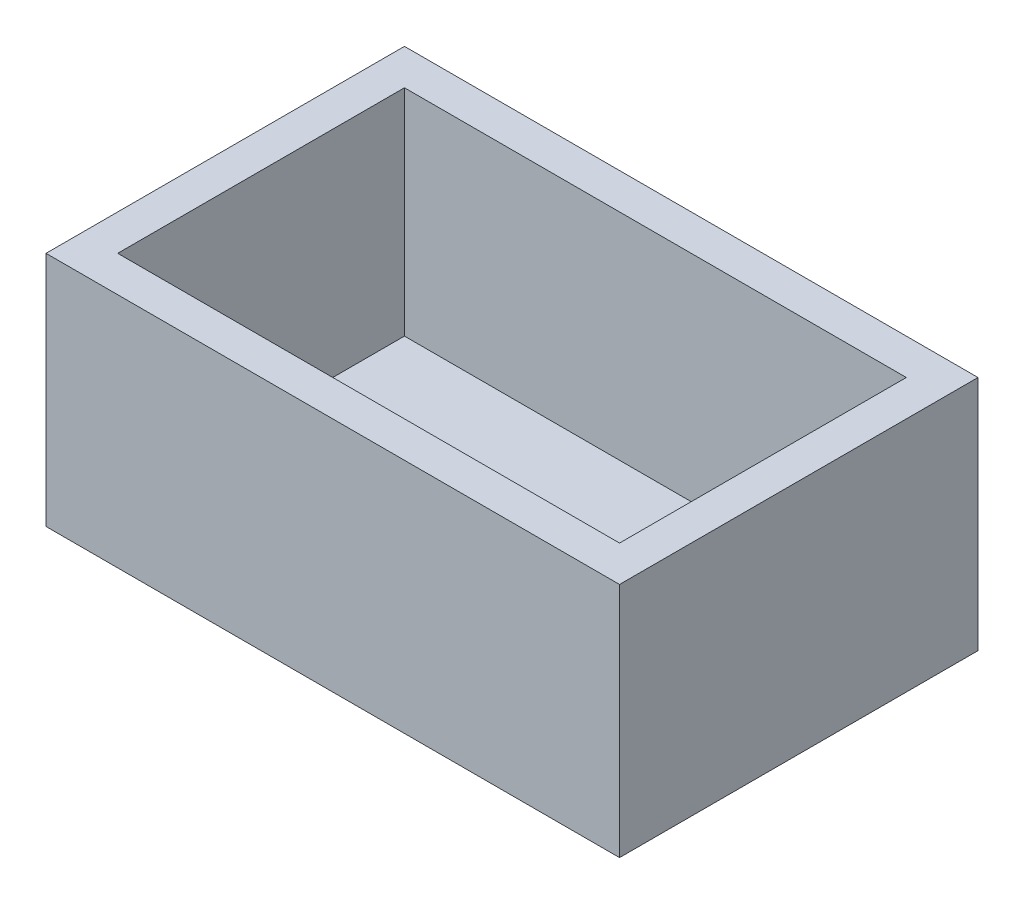
ISO-10303-21;
HEADER;
FILE_DESCRIPTION(('STEP AP214'),'2;1');
FILE_NAME('part.step','',(''),(''),'','','');
FILE_SCHEMA(('AUTOMOTIVE_DESIGN { 1 0 10303 214 1 1 1 1 }'));
ENDSEC;
DATA;
#1=APPLICATION_CONTEXT('core data for automotive mechanical design processes');
#2=APPLICATION_PROTOCOL_DEFINITION('international standard','automotive_design',2000,#1);
#3=PRODUCT_CONTEXT('',#1,'mechanical');
#4=PRODUCT('Part','Part','',(#3));
#5=PRODUCT_RELATED_PRODUCT_CATEGORY('part','',(#4));
#6=PRODUCT_DEFINITION_FORMATION('','',#4);
#7=PRODUCT_DEFINITION_CONTEXT('part definition',#1,'design');
#8=PRODUCT_DEFINITION('design','',#6,#7);
#9=PRODUCT_DEFINITION_SHAPE('','',#8);
#10=(LENGTH_UNIT() NAMED_UNIT(*) SI_UNIT(.MILLI.,.METRE.));
#11=(NAMED_UNIT(*) PLANE_ANGLE_UNIT() SI_UNIT($,.RADIAN.));
#12=(NAMED_UNIT(*) SI_UNIT($,.STERADIAN.) SOLID_ANGLE_UNIT());
#13=UNCERTAINTY_MEASURE_WITH_UNIT(LENGTH_MEASURE(1.E-05),#10,'distance_accuracy_value','');
#14=(GEOMETRIC_REPRESENTATION_CONTEXT(3) GLOBAL_UNCERTAINTY_ASSIGNED_CONTEXT((#13)) GLOBAL_UNIT_ASSIGNED_CONTEXT((#10,
#11,#12)) REPRESENTATION_CONTEXT('',''));
#15=CARTESIAN_POINT('',(0.,0.,0.));
#16=DIRECTION('',(0.,0.,1.));
#17=DIRECTION('',(1.,0.,0.));
#18=AXIS2_PLACEMENT_3D('',#15,#16,#17);
#19=CARTESIAN_POINT('',(40.,3.,-25.));
#20=DIRECTION('',(-1.,0.,0.));
#21=DIRECTION('',(0.,0.,1.));
#22=AXIS2_PLACEMENT_3D('',#19,#20,#21);
#23=PLANE('',#22);
#24=DIRECTION('',(0.,0.,-1.));
#25=VECTOR('',#24,1.);
#26=CARTESIAN_POINT('',(40.,0.,-25.));
#27=LINE('',#26,#25);
#28=CARTESIAN_POINT('',(40.,0.,25.));
#29=VERTEX_POINT('',#28);
#30=CARTESIAN_POINT('',(40.,0.,-25.));
#31=VERTEX_POINT('',#30);
#32=EDGE_CURVE('E144',#29,#31,#27,.T.);
#33=ORIENTED_EDGE('',*,*,#32,.T.);
#34=DIRECTION('',(0.,-1.,0.));
#35=VECTOR('',#34,1.);
#36=CARTESIAN_POINT('',(40.,3.,-25.));
#37=LINE('',#36,#35);
#38=CARTESIAN_POINT('',(40.,33.,-25.));
#39=VERTEX_POINT('',#38);
#40=EDGE_CURVE('E11',#39,#31,#37,.T.);
#41=ORIENTED_EDGE('',*,*,#40,.F.);
#42=DIRECTION('',(0.,0.,-1.));
#43=VECTOR('',#42,1.);
#44=CARTESIAN_POINT('',(40.,33.,25.));
#45=LINE('',#44,#43);
#46=CARTESIAN_POINT('',(40.,33.,25.));
#47=VERTEX_POINT('',#46);
#48=EDGE_CURVE('E135',#47,#39,#45,.T.);
#49=ORIENTED_EDGE('',*,*,#48,.F.);
#50=DIRECTION('',(0.,-1.,0.));
#51=VECTOR('',#50,1.);
#52=CARTESIAN_POINT('',(40.,3.,25.));
#53=LINE('',#52,#51);
#54=EDGE_CURVE('E153',#47,#29,#53,.T.);
#55=ORIENTED_EDGE('',*,*,#54,.T.);
#56=EDGE_LOOP('',(#33,#41,#49,#55));
#57=FACE_BOUND('',#56,.T.);
#58=ADVANCED_FACE('F33',(#57),#23,.F.);
#59=CARTESIAN_POINT('',(-40.,3.,-25.));
#60=DIRECTION('',(0.,0.,1.));
#61=DIRECTION('',(1.,0.,0.));
#62=AXIS2_PLACEMENT_3D('',#59,#60,#61);
#63=PLANE('',#62);
#64=DIRECTION('',(-1.,0.,0.));
#65=VECTOR('',#64,1.);
#66=CARTESIAN_POINT('',(-40.,0.,-25.));
#67=LINE('',#66,#65);
#68=CARTESIAN_POINT('',(-40.,0.,-25.));
#69=VERTEX_POINT('',#68);
#70=EDGE_CURVE('E147',#31,#69,#67,.T.);
#71=ORIENTED_EDGE('',*,*,#70,.T.);
#72=DIRECTION('',(0.,-1.,0.));
#73=VECTOR('',#72,1.);
#74=CARTESIAN_POINT('',(-40.,3.,-25.));
#75=LINE('',#74,#73);
#76=CARTESIAN_POINT('',(-40.,33.,-25.));
#77=VERTEX_POINT('',#76);
#78=EDGE_CURVE('E40',#77,#69,#75,.T.);
#79=ORIENTED_EDGE('',*,*,#78,.F.);
#80=DIRECTION('',(-1.,0.,0.));
#81=VECTOR('',#80,1.);
#82=CARTESIAN_POINT('',(40.,33.,-25.));
#83=LINE('',#82,#81);
#84=EDGE_CURVE('E138',#39,#77,#83,.T.);
#85=ORIENTED_EDGE('',*,*,#84,.F.);
#86=ORIENTED_EDGE('',*,*,#40,.T.);
#87=EDGE_LOOP('',(#71,#79,#85,#86));
#88=FACE_BOUND('',#87,.T.);
#89=ADVANCED_FACE('F175',(#88),#63,.F.);
#90=CARTESIAN_POINT('',(-40.,3.,-25.));
#91=DIRECTION('',(1.,0.,0.));
#92=DIRECTION('',(0.,0.,-1.));
#93=AXIS2_PLACEMENT_3D('',#90,#91,#92);
#94=PLANE('',#93);
#95=DIRECTION('',(0.,0.,1.));
#96=VECTOR('',#95,1.);
#97=CARTESIAN_POINT('',(-40.,0.,-25.));
#98=LINE('',#97,#96);
#99=CARTESIAN_POINT('',(-40.,0.,25.));
#100=VERTEX_POINT('',#99);
#101=EDGE_CURVE('E149',#69,#100,#98,.T.);
#102=ORIENTED_EDGE('',*,*,#101,.T.);
#103=DIRECTION('',(0.,-1.,0.));
#104=VECTOR('',#103,1.);
#105=CARTESIAN_POINT('',(-40.,3.,25.));
#106=LINE('',#105,#104);
#107=CARTESIAN_POINT('',(-40.,33.,25.));
#108=VERTEX_POINT('',#107);
#109=EDGE_CURVE('E156',#108,#100,#106,.T.);
#110=ORIENTED_EDGE('',*,*,#109,.F.);
#111=DIRECTION('',(0.,0.,1.));
#112=VECTOR('',#111,1.);
#113=CARTESIAN_POINT('',(-40.,33.,-25.));
#114=LINE('',#113,#112);
#115=EDGE_CURVE('E141',#77,#108,#114,.T.);
#116=ORIENTED_EDGE('',*,*,#115,.F.);
#117=ORIENTED_EDGE('',*,*,#78,.T.);
#118=EDGE_LOOP('',(#102,#110,#116,#117));
#119=FACE_BOUND('',#118,.T.);
#120=ADVANCED_FACE('F162',(#119),#94,.F.);
#121=CARTESIAN_POINT('',(-40.,3.,25.));
#122=DIRECTION('',(0.,0.,-1.));
#123=DIRECTION('',(-1.,0.,0.));
#124=AXIS2_PLACEMENT_3D('',#121,#122,#123);
#125=PLANE('',#124);
#126=DIRECTION('',(1.,0.,0.));
#127=VECTOR('',#126,1.);
#128=CARTESIAN_POINT('',(-40.,0.,25.));
#129=LINE('',#128,#127);
#130=EDGE_CURVE('E151',#100,#29,#129,.T.);
#131=ORIENTED_EDGE('',*,*,#130,.T.);
#132=ORIENTED_EDGE('',*,*,#54,.F.);
#133=DIRECTION('',(1.,0.,0.));
#134=VECTOR('',#133,1.);
#135=CARTESIAN_POINT('',(-40.,33.,25.));
#136=LINE('',#135,#134);
#137=EDGE_CURVE('E111',#108,#47,#136,.T.);
#138=ORIENTED_EDGE('',*,*,#137,.F.);
#139=ORIENTED_EDGE('',*,*,#109,.T.);
#140=EDGE_LOOP('',(#131,#132,#138,#139));
#141=FACE_BOUND('',#140,.T.);
#142=ADVANCED_FACE('F170',(#141),#125,.F.);
#143=CARTESIAN_POINT('',(0.,0.,0.));
#144=DIRECTION('',(0.,1.,0.));
#145=DIRECTION('',(0.,0.,1.));
#146=AXIS2_PLACEMENT_3D('',#143,#144,#145);
#147=PLANE('',#146);
#148=ORIENTED_EDGE('',*,*,#32,.F.);
#149=ORIENTED_EDGE('',*,*,#130,.F.);
#150=ORIENTED_EDGE('',*,*,#101,.F.);
#151=ORIENTED_EDGE('',*,*,#70,.F.);
#152=EDGE_LOOP('',(#148,#149,#150,#151));
#153=FACE_BOUND('',#152,.T.);
#154=ADVANCED_FACE('F168',(#153),#147,.F.);
#155=CARTESIAN_POINT('',(0.,33.,0.));
#156=DIRECTION('',(0.,1.,0.));
#157=DIRECTION('',(0.,0.,1.));
#158=AXIS2_PLACEMENT_3D('',#155,#156,#157);
#159=PLANE('',#158);
#160=ORIENTED_EDGE('',*,*,#137,.T.);
#161=ORIENTED_EDGE('',*,*,#48,.T.);
#162=ORIENTED_EDGE('',*,*,#84,.T.);
#163=ORIENTED_EDGE('',*,*,#115,.T.);
#164=EDGE_LOOP('',(#160,#161,#162,#163));
#165=FACE_BOUND('',#164,.T.);
#166=DIRECTION('',(0.,0.,1.));
#167=VECTOR('',#166,1.);
#168=CARTESIAN_POINT('',(-35.,33.,-20.));
#169=LINE('',#168,#167);
#170=CARTESIAN_POINT('',(-35.,33.,-20.));
#171=VERTEX_POINT('',#170);
#172=CARTESIAN_POINT('',(-35.,33.,20.));
#173=VERTEX_POINT('',#172);
#174=EDGE_CURVE('E105',#171,#173,#169,.T.);
#175=ORIENTED_EDGE('',*,*,#174,.F.);
#176=DIRECTION('',(-1.,0.,0.));
#177=VECTOR('',#176,1.);
#178=CARTESIAN_POINT('',(35.,33.,-20.));
#179=LINE('',#178,#177);
#180=CARTESIAN_POINT('',(35.,33.,-20.));
#181=VERTEX_POINT('',#180);
#182=EDGE_CURVE('E96',#181,#171,#179,.T.);
#183=ORIENTED_EDGE('',*,*,#182,.F.);
#184=DIRECTION('',(0.,0.,-1.));
#185=VECTOR('',#184,1.);
#186=CARTESIAN_POINT('',(35.,33.,20.));
#187=LINE('',#186,#185);
#188=CARTESIAN_POINT('',(35.,33.,20.));
#189=VERTEX_POINT('',#188);
#190=EDGE_CURVE('E119',#189,#181,#187,.T.);
#191=ORIENTED_EDGE('',*,*,#190,.F.);
#192=DIRECTION('',(1.,0.,0.));
#193=VECTOR('',#192,1.);
#194=CARTESIAN_POINT('',(-35.,33.,20.));
#195=LINE('',#194,#193);
#196=EDGE_CURVE('E117',#173,#189,#195,.T.);
#197=ORIENTED_EDGE('',*,*,#196,.F.);
#198=EDGE_LOOP('',(#175,#183,#191,#197));
#199=FACE_BOUND('',#198,.T.);
#200=ADVANCED_FACE('F115',(#165,#199),#159,.T.);
#201=CARTESIAN_POINT('',(35.,33.,-20.));
#202=DIRECTION('',(0.,0.,1.));
#203=DIRECTION('',(1.,0.,0.));
#204=AXIS2_PLACEMENT_3D('',#201,#202,#203);
#205=PLANE('',#204);
#206=DIRECTION('',(-1.,0.,0.));
#207=VECTOR('',#206,1.);
#208=CARTESIAN_POINT('',(35.,3.,-20.));
#209=LINE('',#208,#207);
#210=CARTESIAN_POINT('',(35.,3.,-20.));
#211=VERTEX_POINT('',#210);
#212=CARTESIAN_POINT('',(-35.,3.,-20.));
#213=VERTEX_POINT('',#212);
#214=EDGE_CURVE('E47',#211,#213,#209,.T.);
#215=ORIENTED_EDGE('',*,*,#214,.F.);
#216=DIRECTION('',(0.,-1.,0.));
#217=VECTOR('',#216,1.);
#218=CARTESIAN_POINT('',(35.,33.,-20.));
#219=LINE('',#218,#217);
#220=EDGE_CURVE('E101',#181,#211,#219,.T.);
#221=ORIENTED_EDGE('',*,*,#220,.F.);
#222=ORIENTED_EDGE('',*,*,#182,.T.);
#223=DIRECTION('',(0.,-1.,0.));
#224=VECTOR('',#223,1.);
#225=CARTESIAN_POINT('',(-35.,33.,-20.));
#226=LINE('',#225,#224);
#227=EDGE_CURVE('E99',#171,#213,#226,.T.);
#228=ORIENTED_EDGE('',*,*,#227,.T.);
#229=EDGE_LOOP('',(#215,#221,#222,#228));
#230=FACE_BOUND('',#229,.T.);
#231=ADVANCED_FACE('F98',(#230),#205,.T.);
#232=CARTESIAN_POINT('',(-35.,33.,-20.));
#233=DIRECTION('',(1.,0.,0.));
#234=DIRECTION('',(0.,0.,-1.));
#235=AXIS2_PLACEMENT_3D('',#232,#233,#234);
#236=PLANE('',#235);
#237=DIRECTION('',(0.,0.,1.));
#238=VECTOR('',#237,1.);
#239=CARTESIAN_POINT('',(-35.,3.,-20.));
#240=LINE('',#239,#238);
#241=CARTESIAN_POINT('',(-35.,3.,20.));
#242=VERTEX_POINT('',#241);
#243=EDGE_CURVE('E51',#213,#242,#240,.T.);
#244=ORIENTED_EDGE('',*,*,#243,.F.);
#245=ORIENTED_EDGE('',*,*,#227,.F.);
#246=ORIENTED_EDGE('',*,*,#174,.T.);
#247=DIRECTION('',(0.,-1.,0.));
#248=VECTOR('',#247,1.);
#249=CARTESIAN_POINT('',(-35.,33.,20.));
#250=LINE('',#249,#248);
#251=EDGE_CURVE('E112',#173,#242,#250,.T.);
#252=ORIENTED_EDGE('',*,*,#251,.T.);
#253=EDGE_LOOP('',(#244,#245,#246,#252));
#254=FACE_BOUND('',#253,.T.);
#255=ADVANCED_FACE('F109',(#254),#236,.T.);
#256=CARTESIAN_POINT('',(-35.,33.,20.));
#257=DIRECTION('',(0.,0.,-1.));
#258=DIRECTION('',(-1.,0.,0.));
#259=AXIS2_PLACEMENT_3D('',#256,#257,#258);
#260=PLANE('',#259);
#261=DIRECTION('',(1.,0.,0.));
#262=VECTOR('',#261,1.);
#263=CARTESIAN_POINT('',(-35.,3.,20.));
#264=LINE('',#263,#262);
#265=CARTESIAN_POINT('',(35.,3.,20.));
#266=VERTEX_POINT('',#265);
#267=EDGE_CURVE('E125',#242,#266,#264,.T.);
#268=ORIENTED_EDGE('',*,*,#267,.F.);
#269=ORIENTED_EDGE('',*,*,#251,.F.);
#270=ORIENTED_EDGE('',*,*,#196,.T.);
#271=DIRECTION('',(0.,-1.,0.));
#272=VECTOR('',#271,1.);
#273=CARTESIAN_POINT('',(35.,33.,20.));
#274=LINE('',#273,#272);
#275=EDGE_CURVE('E129',#189,#266,#274,.T.);
#276=ORIENTED_EDGE('',*,*,#275,.T.);
#277=EDGE_LOOP('',(#268,#269,#270,#276));
#278=FACE_BOUND('',#277,.T.);
#279=ADVANCED_FACE('F197',(#278),#260,.T.);
#280=CARTESIAN_POINT('',(35.,33.,20.));
#281=DIRECTION('',(-1.,0.,0.));
#282=DIRECTION('',(0.,0.,1.));
#283=AXIS2_PLACEMENT_3D('',#280,#281,#282);
#284=PLANE('',#283);
#285=DIRECTION('',(0.,0.,-1.));
#286=VECTOR('',#285,1.);
#287=CARTESIAN_POINT('',(35.,3.,20.));
#288=LINE('',#287,#286);
#289=EDGE_CURVE('E106',#266,#211,#288,.T.);
#290=ORIENTED_EDGE('',*,*,#289,.F.);
#291=ORIENTED_EDGE('',*,*,#275,.F.);
#292=ORIENTED_EDGE('',*,*,#190,.T.);
#293=ORIENTED_EDGE('',*,*,#220,.T.);
#294=EDGE_LOOP('',(#290,#291,#292,#293));
#295=FACE_BOUND('',#294,.T.);
#296=ADVANCED_FACE('F190',(#295),#284,.T.);
#297=CARTESIAN_POINT('',(0.,3.,0.));
#298=DIRECTION('',(0.,1.,0.));
#299=DIRECTION('',(0.,0.,1.));
#300=AXIS2_PLACEMENT_3D('',#297,#298,#299);
#301=PLANE('',#300);
#302=ORIENTED_EDGE('',*,*,#214,.T.);
#303=ORIENTED_EDGE('',*,*,#243,.T.);
#304=ORIENTED_EDGE('',*,*,#267,.T.);
#305=ORIENTED_EDGE('',*,*,#289,.T.);
#306=EDGE_LOOP('',(#302,#303,#304,#305));
#307=FACE_BOUND('',#306,.T.);
#308=ADVANCED_FACE('F187',(#307),#301,.T.);
#309=CLOSED_SHELL('',(#58,#89,#120,#142,#154,#200,#231,#255,#279,#296,#308));
#310=MANIFOLD_SOLID_BREP('B2',#309);
#311=ADVANCED_BREP_SHAPE_REPRESENTATION('',(#18,#310),#14);
#312=SHAPE_DEFINITION_REPRESENTATION(#9,#311);
ENDSEC;
END-ISO-10303-21;
